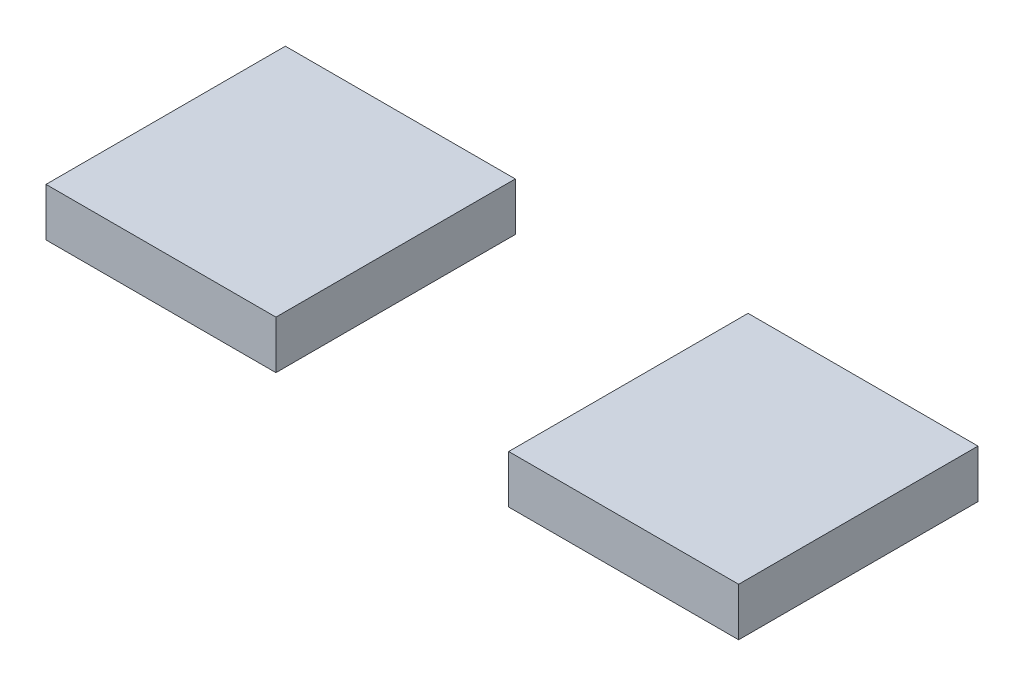
ISO-10303-21;
HEADER;
FILE_DESCRIPTION(('STEP AP214'),'2;1');
FILE_NAME('part.step','',(''),(''),'','','');
FILE_SCHEMA(('AUTOMOTIVE_DESIGN { 1 0 10303 214 1 1 1 1 }'));
ENDSEC;
DATA;
#1=APPLICATION_CONTEXT('core data for automotive mechanical design processes');
#2=APPLICATION_PROTOCOL_DEFINITION('international standard','automotive_design',2000,#1);
#3=PRODUCT_CONTEXT('',#1,'mechanical');
#4=PRODUCT('Part','Part','',(#3));
#5=PRODUCT_RELATED_PRODUCT_CATEGORY('part','',(#4));
#6=PRODUCT_DEFINITION_FORMATION('','',#4);
#7=PRODUCT_DEFINITION_CONTEXT('part definition',#1,'design');
#8=PRODUCT_DEFINITION('design','',#6,#7);
#9=PRODUCT_DEFINITION_SHAPE('','',#8);
#10=(LENGTH_UNIT() NAMED_UNIT(*) SI_UNIT(.MILLI.,.METRE.));
#11=(NAMED_UNIT(*) PLANE_ANGLE_UNIT() SI_UNIT($,.RADIAN.));
#12=(NAMED_UNIT(*) SI_UNIT($,.STERADIAN.) SOLID_ANGLE_UNIT());
#13=UNCERTAINTY_MEASURE_WITH_UNIT(LENGTH_MEASURE(1.E-05),#10,'distance_accuracy_value','');
#14=(GEOMETRIC_REPRESENTATION_CONTEXT(3) GLOBAL_UNCERTAINTY_ASSIGNED_CONTEXT((#13)) GLOBAL_UNIT_ASSIGNED_CONTEXT((#10,
#11,#12)) REPRESENTATION_CONTEXT('',''));
#15=CARTESIAN_POINT('',(0.,0.,0.));
#16=DIRECTION('',(0.,0.,1.));
#17=DIRECTION('',(1.,0.,0.));
#18=AXIS2_PLACEMENT_3D('',#15,#16,#17);
#19=CARTESIAN_POINT('',(-20.2963121439715,6.8,-16.9125702267054));
#20=DIRECTION('',(1.,0.,0.));
#21=DIRECTION('',(0.,0.,-1.));
#22=AXIS2_PLACEMENT_3D('',#19,#20,#21);
#23=PLANE('',#22);
#24=DIRECTION('',(0.,0.,1.));
#25=VECTOR('',#24,1.);
#26=CARTESIAN_POINT('',(-20.2963121439715,0.,-16.9125702267054));
#27=LINE('',#26,#25);
#28=CARTESIAN_POINT('',(-20.2963121439715,0.,-16.9125702267054));
#29=VERTEX_POINT('',#28);
#30=CARTESIAN_POINT('',(-20.2963121439715,0.,16.9125702267054));
#31=VERTEX_POINT('',#30);
#32=EDGE_CURVE('E108',#29,#31,#27,.T.);
#33=ORIENTED_EDGE('',*,*,#32,.T.);
#34=DIRECTION('',(0.,-1.,0.));
#35=VECTOR('',#34,1.);
#36=CARTESIAN_POINT('',(-20.2963121439715,6.8,16.9125702267054));
#37=LINE('',#36,#35);
#38=CARTESIAN_POINT('',(-20.2963121439715,6.8,16.9125702267054));
#39=VERTEX_POINT('',#38);
#40=EDGE_CURVE('E12',#39,#31,#37,.T.);
#41=ORIENTED_EDGE('',*,*,#40,.F.);
#42=DIRECTION('',(0.,0.,1.));
#43=VECTOR('',#42,1.);
#44=CARTESIAN_POINT('',(-20.2963121439715,6.8,-16.9125702267054));
#45=LINE('',#44,#43);
#46=CARTESIAN_POINT('',(-20.2963121439715,6.8,-16.9125702267054));
#47=VERTEX_POINT('',#46);
#48=EDGE_CURVE('E96',#47,#39,#45,.T.);
#49=ORIENTED_EDGE('',*,*,#48,.F.);
#50=DIRECTION('',(0.,-1.,0.));
#51=VECTOR('',#50,1.);
#52=CARTESIAN_POINT('',(-20.2963121439715,6.8,-16.9125702267054));
#53=LINE('',#52,#51);
#54=EDGE_CURVE('E104',#47,#29,#53,.T.);
#55=ORIENTED_EDGE('',*,*,#54,.T.);
#56=EDGE_LOOP('',(#33,#41,#49,#55));
#57=FACE_BOUND('',#56,.T.);
#58=ADVANCED_FACE('F45',(#57),#23,.F.);
#59=CARTESIAN_POINT('',(12.1971298663916,6.8,16.9125702267054));
#60=DIRECTION('',(0.,0.,-1.));
#61=DIRECTION('',(-1.,0.,0.));
#62=AXIS2_PLACEMENT_3D('',#59,#60,#61);
#63=PLANE('',#62);
#64=DIRECTION('',(1.,0.,0.));
#65=VECTOR('',#64,1.);
#66=CARTESIAN_POINT('',(12.1971298663916,0.,16.9125702267054));
#67=LINE('',#66,#65);
#68=CARTESIAN_POINT('',(12.1971298663916,0.,16.9125702267054));
#69=VERTEX_POINT('',#68);
#70=EDGE_CURVE('E100',#31,#69,#67,.T.);
#71=ORIENTED_EDGE('',*,*,#70,.T.);
#72=DIRECTION('',(0.,-1.,0.));
#73=VECTOR('',#72,1.);
#74=CARTESIAN_POINT('',(12.1971298663916,6.8,16.9125702267054));
#75=LINE('',#74,#73);
#76=CARTESIAN_POINT('',(12.1971298663916,6.8,16.9125702267054));
#77=VERTEX_POINT('',#76);
#78=EDGE_CURVE('E53',#77,#69,#75,.T.);
#79=ORIENTED_EDGE('',*,*,#78,.F.);
#80=DIRECTION('',(1.,0.,0.));
#81=VECTOR('',#80,1.);
#82=CARTESIAN_POINT('',(12.1971298663916,6.8,16.9125702267054));
#83=LINE('',#82,#81);
#84=EDGE_CURVE('E91',#39,#77,#83,.T.);
#85=ORIENTED_EDGE('',*,*,#84,.F.);
#86=ORIENTED_EDGE('',*,*,#40,.T.);
#87=EDGE_LOOP('',(#71,#79,#85,#86));
#88=FACE_BOUND('',#87,.T.);
#89=ADVANCED_FACE('F99',(#88),#63,.F.);
#90=CARTESIAN_POINT('',(12.1971298663916,6.8,-16.9125702267054));
#91=DIRECTION('',(-1.,0.,0.));
#92=DIRECTION('',(0.,0.,1.));
#93=AXIS2_PLACEMENT_3D('',#90,#91,#92);
#94=PLANE('',#93);
#95=DIRECTION('',(0.,0.,-1.));
#96=VECTOR('',#95,1.);
#97=CARTESIAN_POINT('',(12.1971298663916,0.,-16.9125702267054));
#98=LINE('',#97,#96);
#99=CARTESIAN_POINT('',(12.1971298663916,0.,-16.9125702267054));
#100=VERTEX_POINT('',#99);
#101=EDGE_CURVE('E78',#69,#100,#98,.T.);
#102=ORIENTED_EDGE('',*,*,#101,.T.);
#103=DIRECTION('',(0.,-1.,0.));
#104=VECTOR('',#103,1.);
#105=CARTESIAN_POINT('',(12.1971298663916,6.8,-16.9125702267054));
#106=LINE('',#105,#104);
#107=CARTESIAN_POINT('',(12.1971298663916,6.8,-16.9125702267054));
#108=VERTEX_POINT('',#107);
#109=EDGE_CURVE('E101',#108,#100,#106,.T.);
#110=ORIENTED_EDGE('',*,*,#109,.F.);
#111=DIRECTION('',(0.,0.,-1.));
#112=VECTOR('',#111,1.);
#113=CARTESIAN_POINT('',(12.1971298663916,6.8,-16.9125702267054));
#114=LINE('',#113,#112);
#115=EDGE_CURVE('E94',#77,#108,#114,.T.);
#116=ORIENTED_EDGE('',*,*,#115,.F.);
#117=ORIENTED_EDGE('',*,*,#78,.T.);
#118=EDGE_LOOP('',(#102,#110,#116,#117));
#119=FACE_BOUND('',#118,.T.);
#120=ADVANCED_FACE('F102',(#119),#94,.F.);
#121=CARTESIAN_POINT('',(12.1971298663916,6.8,-16.9125702267054));
#122=DIRECTION('',(0.,0.,1.));
#123=DIRECTION('',(1.,0.,0.));
#124=AXIS2_PLACEMENT_3D('',#121,#122,#123);
#125=PLANE('',#124);
#126=DIRECTION('',(-1.,0.,0.));
#127=VECTOR('',#126,1.);
#128=CARTESIAN_POINT('',(12.1971298663916,0.,-16.9125702267054));
#129=LINE('',#128,#127);
#130=EDGE_CURVE('E84',#100,#29,#129,.T.);
#131=ORIENTED_EDGE('',*,*,#130,.T.);
#132=ORIENTED_EDGE('',*,*,#54,.F.);
#133=DIRECTION('',(-1.,0.,0.));
#134=VECTOR('',#133,1.);
#135=CARTESIAN_POINT('',(12.1971298663916,6.8,-16.9125702267054));
#136=LINE('',#135,#134);
#137=EDGE_CURVE('E61',#108,#47,#136,.T.);
#138=ORIENTED_EDGE('',*,*,#137,.F.);
#139=ORIENTED_EDGE('',*,*,#109,.T.);
#140=EDGE_LOOP('',(#131,#132,#138,#139));
#141=FACE_BOUND('',#140,.T.);
#142=ADVANCED_FACE('F115',(#141),#125,.F.);
#143=CARTESIAN_POINT('',(-73.485550999294,6.8,0.));
#144=DIRECTION('',(0.,-1.,0.));
#145=DIRECTION('',(0.,0.,1.));
#146=AXIS2_PLACEMENT_3D('',#143,#144,#145);
#147=PLANE('',#146);
#148=ORIENTED_EDGE('',*,*,#48,.T.);
#149=ORIENTED_EDGE('',*,*,#84,.T.);
#150=ORIENTED_EDGE('',*,*,#115,.T.);
#151=ORIENTED_EDGE('',*,*,#137,.T.);
#152=EDGE_LOOP('',(#148,#149,#150,#151));
#153=FACE_BOUND('',#152,.T.);
#154=ADVANCED_FACE('F92',(#153),#147,.F.);
#155=CARTESIAN_POINT('',(-73.485550999294,0.,0.));
#156=DIRECTION('',(0.,-1.,0.));
#157=DIRECTION('',(0.,0.,1.));
#158=AXIS2_PLACEMENT_3D('',#155,#156,#157);
#159=PLANE('',#158);
#160=ORIENTED_EDGE('',*,*,#32,.F.);
#161=ORIENTED_EDGE('',*,*,#130,.F.);
#162=ORIENTED_EDGE('',*,*,#101,.F.);
#163=ORIENTED_EDGE('',*,*,#70,.F.);
#164=EDGE_LOOP('',(#160,#161,#162,#163));
#165=FACE_BOUND('',#164,.T.);
#166=ADVANCED_FACE('F118',(#165),#159,.T.);
#167=CLOSED_SHELL('',(#58,#89,#120,#142,#154,#166));
#168=MANIFOLD_SOLID_BREP('B2',#167);
#169=CARTESIAN_POINT('',(-53.1892388553225,6.8,16.9125702267054));
#170=DIRECTION('',(-1.,0.,0.));
#171=DIRECTION('',(0.,0.,1.));
#172=AXIS2_PLACEMENT_3D('',#169,#170,#171);
#173=PLANE('',#172);
#174=DIRECTION('',(0.,0.,-1.));
#175=VECTOR('',#174,1.);
#176=CARTESIAN_POINT('',(-53.1892388553225,0.,16.9125702267054));
#177=LINE('',#176,#175);
#178=CARTESIAN_POINT('',(-53.1892388553225,0.,16.9125702267054));
#179=VERTEX_POINT('',#178);
#180=CARTESIAN_POINT('',(-53.1892388553225,0.,-16.9125702267054));
#181=VERTEX_POINT('',#180);
#182=EDGE_CURVE('E232',#179,#181,#177,.T.);
#183=ORIENTED_EDGE('',*,*,#182,.T.);
#184=DIRECTION('',(0.,-1.,0.));
#185=VECTOR('',#184,1.);
#186=CARTESIAN_POINT('',(-53.1892388553225,6.8,-16.9125702267054));
#187=LINE('',#186,#185);
#188=CARTESIAN_POINT('',(-53.1892388553225,6.8,-16.9125702267054));
#189=VERTEX_POINT('',#188);
#190=EDGE_CURVE('E43',#189,#181,#187,.T.);
#191=ORIENTED_EDGE('',*,*,#190,.F.);
#192=DIRECTION('',(0.,0.,-1.));
#193=VECTOR('',#192,1.);
#194=CARTESIAN_POINT('',(-53.1892388553225,6.8,16.9125702267054));
#195=LINE('',#194,#193);
#196=CARTESIAN_POINT('',(-53.1892388553225,6.8,16.9125702267054));
#197=VERTEX_POINT('',#196);
#198=EDGE_CURVE('E220',#197,#189,#195,.T.);
#199=ORIENTED_EDGE('',*,*,#198,.F.);
#200=DIRECTION('',(0.,-1.,0.));
#201=VECTOR('',#200,1.);
#202=CARTESIAN_POINT('',(-53.1892388553225,6.8,16.9125702267054));
#203=LINE('',#202,#201);
#204=EDGE_CURVE('E228',#197,#179,#203,.T.);
#205=ORIENTED_EDGE('',*,*,#204,.T.);
#206=EDGE_LOOP('',(#183,#191,#199,#205));
#207=FACE_BOUND('',#206,.T.);
#208=ADVANCED_FACE('F169',(#207),#173,.F.);
#209=CARTESIAN_POINT('',(-85.6826808656856,6.8,-16.9125702267054));
#210=DIRECTION('',(0.,0.,1.));
#211=DIRECTION('',(1.,0.,0.));
#212=AXIS2_PLACEMENT_3D('',#209,#210,#211);
#213=PLANE('',#212);
#214=DIRECTION('',(-1.,0.,0.));
#215=VECTOR('',#214,1.);
#216=CARTESIAN_POINT('',(-85.6826808656856,0.,-16.9125702267054));
#217=LINE('',#216,#215);
#218=CARTESIAN_POINT('',(-85.6826808656856,0.,-16.9125702267054));
#219=VERTEX_POINT('',#218);
#220=EDGE_CURVE('E224',#181,#219,#217,.T.);
#221=ORIENTED_EDGE('',*,*,#220,.T.);
#222=DIRECTION('',(0.,-1.,0.));
#223=VECTOR('',#222,1.);
#224=CARTESIAN_POINT('',(-85.6826808656856,6.8,-16.9125702267054));
#225=LINE('',#224,#223);
#226=CARTESIAN_POINT('',(-85.6826808656856,6.8,-16.9125702267054));
#227=VERTEX_POINT('',#226);
#228=EDGE_CURVE('E177',#227,#219,#225,.T.);
#229=ORIENTED_EDGE('',*,*,#228,.F.);
#230=DIRECTION('',(-1.,0.,0.));
#231=VECTOR('',#230,1.);
#232=CARTESIAN_POINT('',(-85.6826808656856,6.8,-16.9125702267054));
#233=LINE('',#232,#231);
#234=EDGE_CURVE('E215',#189,#227,#233,.T.);
#235=ORIENTED_EDGE('',*,*,#234,.F.);
#236=ORIENTED_EDGE('',*,*,#190,.T.);
#237=EDGE_LOOP('',(#221,#229,#235,#236));
#238=FACE_BOUND('',#237,.T.);
#239=ADVANCED_FACE('F223',(#238),#213,.F.);
#240=CARTESIAN_POINT('',(-85.6826808656856,6.8,16.9125702267054));
#241=DIRECTION('',(1.,0.,0.));
#242=DIRECTION('',(0.,0.,-1.));
#243=AXIS2_PLACEMENT_3D('',#240,#241,#242);
#244=PLANE('',#243);
#245=DIRECTION('',(0.,0.,1.));
#246=VECTOR('',#245,1.);
#247=CARTESIAN_POINT('',(-85.6826808656856,0.,16.9125702267054));
#248=LINE('',#247,#246);
#249=CARTESIAN_POINT('',(-85.6826808656856,0.,16.9125702267054));
#250=VERTEX_POINT('',#249);
#251=EDGE_CURVE('E202',#219,#250,#248,.T.);
#252=ORIENTED_EDGE('',*,*,#251,.T.);
#253=DIRECTION('',(0.,-1.,0.));
#254=VECTOR('',#253,1.);
#255=CARTESIAN_POINT('',(-85.6826808656856,6.8,16.9125702267054));
#256=LINE('',#255,#254);
#257=CARTESIAN_POINT('',(-85.6826808656856,6.8,16.9125702267054));
#258=VERTEX_POINT('',#257);
#259=EDGE_CURVE('E225',#258,#250,#256,.T.);
#260=ORIENTED_EDGE('',*,*,#259,.F.);
#261=DIRECTION('',(0.,0.,1.));
#262=VECTOR('',#261,1.);
#263=CARTESIAN_POINT('',(-85.6826808656856,6.8,16.9125702267054));
#264=LINE('',#263,#262);
#265=EDGE_CURVE('E218',#227,#258,#264,.T.);
#266=ORIENTED_EDGE('',*,*,#265,.F.);
#267=ORIENTED_EDGE('',*,*,#228,.T.);
#268=EDGE_LOOP('',(#252,#260,#266,#267));
#269=FACE_BOUND('',#268,.T.);
#270=ADVANCED_FACE('F226',(#269),#244,.F.);
#271=CARTESIAN_POINT('',(-85.6826808656856,6.8,16.9125702267054));
#272=DIRECTION('',(0.,0.,-1.));
#273=DIRECTION('',(-1.,0.,0.));
#274=AXIS2_PLACEMENT_3D('',#271,#272,#273);
#275=PLANE('',#274);
#276=DIRECTION('',(1.,0.,0.));
#277=VECTOR('',#276,1.);
#278=CARTESIAN_POINT('',(-85.6826808656856,0.,16.9125702267054));
#279=LINE('',#278,#277);
#280=EDGE_CURVE('E208',#250,#179,#279,.T.);
#281=ORIENTED_EDGE('',*,*,#280,.T.);
#282=ORIENTED_EDGE('',*,*,#204,.F.);
#283=DIRECTION('',(1.,0.,0.));
#284=VECTOR('',#283,1.);
#285=CARTESIAN_POINT('',(-85.6826808656856,6.8,16.9125702267054));
#286=LINE('',#285,#284);
#287=EDGE_CURVE('E185',#258,#197,#286,.T.);
#288=ORIENTED_EDGE('',*,*,#287,.F.);
#289=ORIENTED_EDGE('',*,*,#259,.T.);
#290=EDGE_LOOP('',(#281,#282,#288,#289));
#291=FACE_BOUND('',#290,.T.);
#292=ADVANCED_FACE('F239',(#291),#275,.F.);
#293=CARTESIAN_POINT('',(0.,6.8,0.));
#294=DIRECTION('',(0.,-1.,0.));
#295=DIRECTION('',(0.,0.,-1.));
#296=AXIS2_PLACEMENT_3D('',#293,#294,#295);
#297=PLANE('',#296);
#298=ORIENTED_EDGE('',*,*,#198,.T.);
#299=ORIENTED_EDGE('',*,*,#234,.T.);
#300=ORIENTED_EDGE('',*,*,#265,.T.);
#301=ORIENTED_EDGE('',*,*,#287,.T.);
#302=EDGE_LOOP('',(#298,#299,#300,#301));
#303=FACE_BOUND('',#302,.T.);
#304=ADVANCED_FACE('F216',(#303),#297,.F.);
#305=CARTESIAN_POINT('',(0.,0.,0.));
#306=DIRECTION('',(0.,-1.,0.));
#307=DIRECTION('',(0.,0.,-1.));
#308=AXIS2_PLACEMENT_3D('',#305,#306,#307);
#309=PLANE('',#308);
#310=ORIENTED_EDGE('',*,*,#182,.F.);
#311=ORIENTED_EDGE('',*,*,#280,.F.);
#312=ORIENTED_EDGE('',*,*,#251,.F.);
#313=ORIENTED_EDGE('',*,*,#220,.F.);
#314=EDGE_LOOP('',(#310,#311,#312,#313));
#315=FACE_BOUND('',#314,.T.);
#316=ADVANCED_FACE('F242',(#315),#309,.T.);
#317=CLOSED_SHELL('',(#208,#239,#270,#292,#304,#316));
#318=MANIFOLD_SOLID_BREP('B6',#317);
#319=ADVANCED_BREP_SHAPE_REPRESENTATION('',(#18,#168,#318),#14);
#320=SHAPE_DEFINITION_REPRESENTATION(#9,#319);
ENDSEC;
END-ISO-10303-21;
